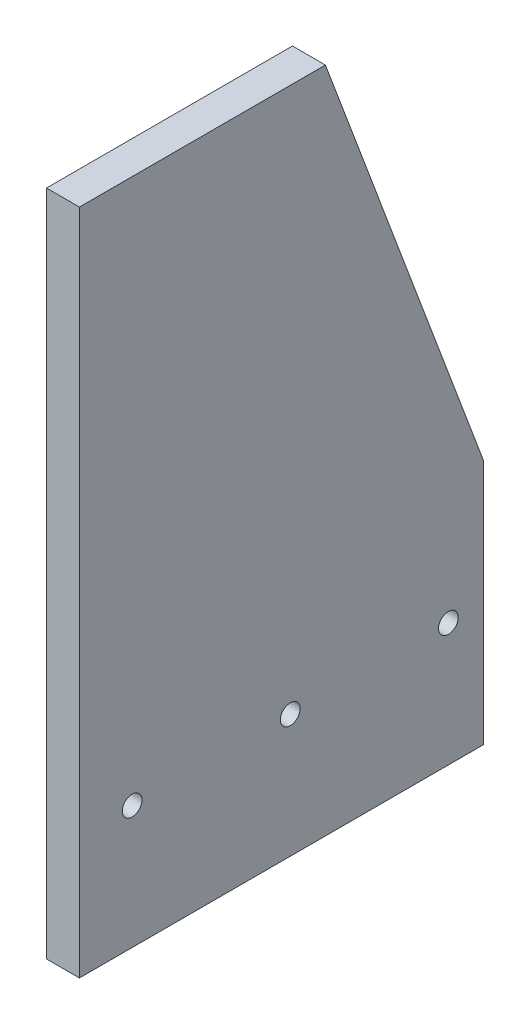
ISO-10303-21;
HEADER;
FILE_DESCRIPTION(('STEP AP214'),'2;1');
FILE_NAME('part.step','',(''),(''),'','','');
FILE_SCHEMA(('AUTOMOTIVE_DESIGN { 1 0 10303 214 1 1 1 1 }'));
ENDSEC;
DATA;
#1=APPLICATION_CONTEXT('core data for automotive mechanical design processes');
#2=APPLICATION_PROTOCOL_DEFINITION('international standard','automotive_design',2000,#1);
#3=PRODUCT_CONTEXT('',#1,'mechanical');
#4=PRODUCT('Part','Part','',(#3));
#5=PRODUCT_RELATED_PRODUCT_CATEGORY('part','',(#4));
#6=PRODUCT_DEFINITION_FORMATION('','',#4);
#7=PRODUCT_DEFINITION_CONTEXT('part definition',#1,'design');
#8=PRODUCT_DEFINITION('design','',#6,#7);
#9=PRODUCT_DEFINITION_SHAPE('','',#8);
#10=(LENGTH_UNIT() NAMED_UNIT(*) SI_UNIT(.MILLI.,.METRE.));
#11=(NAMED_UNIT(*) PLANE_ANGLE_UNIT() SI_UNIT($,.RADIAN.));
#12=(NAMED_UNIT(*) SI_UNIT($,.STERADIAN.) SOLID_ANGLE_UNIT());
#13=UNCERTAINTY_MEASURE_WITH_UNIT(LENGTH_MEASURE(1.E-05),#10,'distance_accuracy_value','');
#14=(GEOMETRIC_REPRESENTATION_CONTEXT(3) GLOBAL_UNCERTAINTY_ASSIGNED_CONTEXT((#13)) GLOBAL_UNIT_ASSIGNED_CONTEXT((#10,
#11,#12)) REPRESENTATION_CONTEXT('',''));
#15=CARTESIAN_POINT('',(0.,0.,0.));
#16=DIRECTION('',(0.,0.,1.));
#17=DIRECTION('',(1.,0.,0.));
#18=AXIS2_PLACEMENT_3D('',#15,#16,#17);
#19=CARTESIAN_POINT('',(11.90625,0.,0.));
#20=DIRECTION('',(-1.,0.,0.));
#21=DIRECTION('',(0.,0.,1.));
#22=AXIS2_PLACEMENT_3D('',#19,#20,#21);
#23=PLANE('',#22);
#24=DIRECTION('',(0.,0.,-1.));
#25=VECTOR('',#24,1.);
#26=CARTESIAN_POINT('',(11.90625,0.,-146.05));
#27=LINE('',#26,#25);
#28=CARTESIAN_POINT('',(11.90625,0.,0.));
#29=VERTEX_POINT('',#28);
#30=CARTESIAN_POINT('',(11.90625,0.,-146.05));
#31=VERTEX_POINT('',#30);
#32=EDGE_CURVE('E131',#29,#31,#27,.T.);
#33=ORIENTED_EDGE('',*,*,#32,.T.);
#34=DIRECTION('',(0.,1.,0.));
#35=VECTOR('',#34,1.);
#36=CARTESIAN_POINT('',(11.90625,88.9,-146.05));
#37=LINE('',#36,#35);
#38=CARTESIAN_POINT('',(11.90625,88.9,-146.05));
#39=VERTEX_POINT('',#38);
#40=EDGE_CURVE('E88',#31,#39,#37,.T.);
#41=ORIENTED_EDGE('',*,*,#40,.T.);
#42=DIRECTION('',(0.,0.936329177569044,0.351123441588392));
#43=VECTOR('',#42,1.);
#44=CARTESIAN_POINT('',(11.90625,241.3,-88.9));
#45=LINE('',#44,#43);
#46=CARTESIAN_POINT('',(11.90625,241.3,-88.9));
#47=VERTEX_POINT('',#46);
#48=EDGE_CURVE('E92',#39,#47,#45,.T.);
#49=ORIENTED_EDGE('',*,*,#48,.T.);
#50=DIRECTION('',(0.,0.,1.));
#51=VECTOR('',#50,1.);
#52=CARTESIAN_POINT('',(11.90625,241.3,0.));
#53=LINE('',#52,#51);
#54=CARTESIAN_POINT('',(11.90625,241.3,0.));
#55=VERTEX_POINT('',#54);
#56=EDGE_CURVE('E96',#47,#55,#53,.T.);
#57=ORIENTED_EDGE('',*,*,#56,.T.);
#58=DIRECTION('',(0.,-1.,0.));
#59=VECTOR('',#58,1.);
#60=CARTESIAN_POINT('',(11.90625,0.,0.));
#61=LINE('',#60,#59);
#62=EDGE_CURVE('E54',#55,#29,#61,.T.);
#63=ORIENTED_EDGE('',*,*,#62,.T.);
#64=EDGE_LOOP('',(#33,#41,#49,#57,#63));
#65=FACE_BOUND('',#64,.T.);
#66=CARTESIAN_POINT('',(11.90625,44.45,-19.05));
#67=DIRECTION('',(1.,0.,0.));
#68=DIRECTION('',(0.,0.,-1.));
#69=AXIS2_PLACEMENT_3D('',#66,#67,#68);
#70=CIRCLE('',#69,3.571875);
#71=CARTESIAN_POINT('',(11.90625,44.45,-22.621875));
#72=VERTEX_POINT('',#71);
#73=EDGE_CURVE('E122',#72,#72,#70,.T.);
#74=ORIENTED_EDGE('',*,*,#73,.F.);
#75=EDGE_LOOP('',(#74));
#76=FACE_BOUND('',#75,.T.);
#77=CARTESIAN_POINT('',(11.90625,44.45,-76.2));
#78=DIRECTION('',(1.,0.,0.));
#79=DIRECTION('',(0.,0.,-1.));
#80=AXIS2_PLACEMENT_3D('',#77,#78,#79);
#81=CIRCLE('',#80,3.57187500000001);
#82=CARTESIAN_POINT('',(11.90625,44.45,-79.771875));
#83=VERTEX_POINT('',#82);
#84=EDGE_CURVE('E187',#83,#83,#81,.T.);
#85=ORIENTED_EDGE('',*,*,#84,.F.);
#86=EDGE_LOOP('',(#85));
#87=FACE_BOUND('',#86,.T.);
#88=CARTESIAN_POINT('',(11.90625,44.45,-133.35));
#89=DIRECTION('',(1.,0.,0.));
#90=DIRECTION('',(0.,0.,-1.));
#91=AXIS2_PLACEMENT_3D('',#88,#89,#90);
#92=CIRCLE('',#91,3.57187500000001);
#93=CARTESIAN_POINT('',(11.90625,44.45,-136.921875));
#94=VERTEX_POINT('',#93);
#95=EDGE_CURVE('E175',#94,#94,#92,.T.);
#96=ORIENTED_EDGE('',*,*,#95,.F.);
#97=EDGE_LOOP('',(#96));
#98=FACE_BOUND('',#97,.T.);
#99=ADVANCED_FACE('F36',(#65,#76,#87,#98),#23,.F.);
#100=CARTESIAN_POINT('',(0.,0.,0.));
#101=DIRECTION('',(-1.,0.,0.));
#102=DIRECTION('',(0.,0.,1.));
#103=AXIS2_PLACEMENT_3D('',#100,#101,#102);
#104=PLANE('',#103);
#105=CARTESIAN_POINT('',(0.,44.45,-76.2));
#106=DIRECTION('',(1.,0.,0.));
#107=DIRECTION('',(0.,0.,-1.));
#108=AXIS2_PLACEMENT_3D('',#105,#106,#107);
#109=CIRCLE('',#108,3.57187500000001);
#110=CARTESIAN_POINT('',(0.,44.45,-79.771875));
#111=VERTEX_POINT('',#110);
#112=EDGE_CURVE('E184',#111,#111,#109,.T.);
#113=ORIENTED_EDGE('',*,*,#112,.T.);
#114=EDGE_LOOP('',(#113));
#115=FACE_BOUND('',#114,.T.);
#116=DIRECTION('',(0.,0.,-1.));
#117=VECTOR('',#116,1.);
#118=CARTESIAN_POINT('',(0.,0.,-146.05));
#119=LINE('',#118,#117);
#120=CARTESIAN_POINT('',(0.,0.,0.));
#121=VERTEX_POINT('',#120);
#122=CARTESIAN_POINT('',(0.,0.,-146.05));
#123=VERTEX_POINT('',#122);
#124=EDGE_CURVE('E117',#121,#123,#119,.T.);
#125=ORIENTED_EDGE('',*,*,#124,.F.);
#126=DIRECTION('',(0.,-1.,0.));
#127=VECTOR('',#126,1.);
#128=CARTESIAN_POINT('',(0.,0.,0.));
#129=LINE('',#128,#127);
#130=CARTESIAN_POINT('',(0.,241.3,0.));
#131=VERTEX_POINT('',#130);
#132=EDGE_CURVE('E80',#131,#121,#129,.T.);
#133=ORIENTED_EDGE('',*,*,#132,.F.);
#134=DIRECTION('',(0.,0.,1.));
#135=VECTOR('',#134,1.);
#136=CARTESIAN_POINT('',(0.,241.3,0.));
#137=LINE('',#136,#135);
#138=CARTESIAN_POINT('',(0.,241.3,-88.9));
#139=VERTEX_POINT('',#138);
#140=EDGE_CURVE('E74',#139,#131,#137,.T.);
#141=ORIENTED_EDGE('',*,*,#140,.F.);
#142=DIRECTION('',(0.,0.936329177569044,0.351123441588392));
#143=VECTOR('',#142,1.);
#144=CARTESIAN_POINT('',(0.,241.3,-88.9));
#145=LINE('',#144,#143);
#146=CARTESIAN_POINT('',(0.,88.9,-146.05));
#147=VERTEX_POINT('',#146);
#148=EDGE_CURVE('E104',#147,#139,#145,.T.);
#149=ORIENTED_EDGE('',*,*,#148,.F.);
#150=DIRECTION('',(0.,1.,0.));
#151=VECTOR('',#150,1.);
#152=CARTESIAN_POINT('',(0.,88.9,-146.05));
#153=LINE('',#152,#151);
#154=EDGE_CURVE('E121',#123,#147,#153,.T.);
#155=ORIENTED_EDGE('',*,*,#154,.F.);
#156=EDGE_LOOP('',(#125,#133,#141,#149,#155));
#157=FACE_BOUND('',#156,.T.);
#158=CARTESIAN_POINT('',(0.,44.45,-19.05));
#159=DIRECTION('',(1.,0.,0.));
#160=DIRECTION('',(0.,0.,-1.));
#161=AXIS2_PLACEMENT_3D('',#158,#159,#160);
#162=CIRCLE('',#161,3.571875);
#163=CARTESIAN_POINT('',(0.,44.45,-22.621875));
#164=VERTEX_POINT('',#163);
#165=EDGE_CURVE('E191',#164,#164,#162,.T.);
#166=ORIENTED_EDGE('',*,*,#165,.T.);
#167=EDGE_LOOP('',(#166));
#168=FACE_BOUND('',#167,.T.);
#169=CARTESIAN_POINT('',(0.,44.45,-133.35));
#170=DIRECTION('',(1.,0.,0.));
#171=DIRECTION('',(0.,0.,-1.));
#172=AXIS2_PLACEMENT_3D('',#169,#170,#171);
#173=CIRCLE('',#172,3.57187500000001);
#174=CARTESIAN_POINT('',(0.,44.45,-136.921875));
#175=VERTEX_POINT('',#174);
#176=EDGE_CURVE('E178',#175,#175,#173,.T.);
#177=ORIENTED_EDGE('',*,*,#176,.T.);
#178=EDGE_LOOP('',(#177));
#179=FACE_BOUND('',#178,.T.);
#180=ADVANCED_FACE('F139',(#115,#157,#168,#179),#104,.T.);
#181=CARTESIAN_POINT('',(11.90625,0.,-146.05));
#182=DIRECTION('',(0.,1.,0.));
#183=DIRECTION('',(0.,0.,1.));
#184=AXIS2_PLACEMENT_3D('',#181,#182,#183);
#185=PLANE('',#184);
#186=ORIENTED_EDGE('',*,*,#124,.T.);
#187=DIRECTION('',(-1.,0.,0.));
#188=VECTOR('',#187,1.);
#189=CARTESIAN_POINT('',(11.90625,0.,-146.05));
#190=LINE('',#189,#188);
#191=EDGE_CURVE('E11',#31,#123,#190,.T.);
#192=ORIENTED_EDGE('',*,*,#191,.F.);
#193=ORIENTED_EDGE('',*,*,#32,.F.);
#194=DIRECTION('',(-1.,0.,0.));
#195=VECTOR('',#194,1.);
#196=CARTESIAN_POINT('',(11.90625,0.,0.));
#197=LINE('',#196,#195);
#198=EDGE_CURVE('E113',#29,#121,#197,.T.);
#199=ORIENTED_EDGE('',*,*,#198,.T.);
#200=EDGE_LOOP('',(#186,#192,#193,#199));
#201=FACE_BOUND('',#200,.T.);
#202=ADVANCED_FACE('F38',(#201),#185,.F.);
#203=CARTESIAN_POINT('',(11.90625,88.9,-146.05));
#204=DIRECTION('',(0.,0.,1.));
#205=DIRECTION('',(1.,0.,0.));
#206=AXIS2_PLACEMENT_3D('',#203,#204,#205);
#207=PLANE('',#206);
#208=ORIENTED_EDGE('',*,*,#154,.T.);
#209=DIRECTION('',(-1.,0.,0.));
#210=VECTOR('',#209,1.);
#211=CARTESIAN_POINT('',(11.90625,88.9,-146.05));
#212=LINE('',#211,#210);
#213=EDGE_CURVE('E46',#39,#147,#212,.T.);
#214=ORIENTED_EDGE('',*,*,#213,.F.);
#215=ORIENTED_EDGE('',*,*,#40,.F.);
#216=ORIENTED_EDGE('',*,*,#191,.T.);
#217=EDGE_LOOP('',(#208,#214,#215,#216));
#218=FACE_BOUND('',#217,.T.);
#219=ADVANCED_FACE('F251',(#218),#207,.F.);
#220=CARTESIAN_POINT('',(11.90625,241.3,-88.9));
#221=DIRECTION('',(0.,-0.351123441588392,0.936329177569044));
#222=DIRECTION('',(0.,-0.936329177569045,-0.351123441588392));
#223=AXIS2_PLACEMENT_3D('',#220,#221,#222);
#224=PLANE('',#223);
#225=ORIENTED_EDGE('',*,*,#148,.T.);
#226=DIRECTION('',(-1.,0.,0.));
#227=VECTOR('',#226,1.);
#228=CARTESIAN_POINT('',(11.90625,241.3,-88.9));
#229=LINE('',#228,#227);
#230=EDGE_CURVE('E101',#47,#139,#229,.T.);
#231=ORIENTED_EDGE('',*,*,#230,.F.);
#232=ORIENTED_EDGE('',*,*,#48,.F.);
#233=ORIENTED_EDGE('',*,*,#213,.T.);
#234=EDGE_LOOP('',(#225,#231,#232,#233));
#235=FACE_BOUND('',#234,.T.);
#236=ADVANCED_FACE('F102',(#235),#224,.F.);
#237=CARTESIAN_POINT('',(11.90625,241.3,0.));
#238=DIRECTION('',(0.,-1.,0.));
#239=DIRECTION('',(0.,0.,-1.));
#240=AXIS2_PLACEMENT_3D('',#237,#238,#239);
#241=PLANE('',#240);
#242=ORIENTED_EDGE('',*,*,#140,.T.);
#243=DIRECTION('',(-1.,0.,0.));
#244=VECTOR('',#243,1.);
#245=CARTESIAN_POINT('',(11.90625,241.3,0.));
#246=LINE('',#245,#244);
#247=EDGE_CURVE('E106',#55,#131,#246,.T.);
#248=ORIENTED_EDGE('',*,*,#247,.F.);
#249=ORIENTED_EDGE('',*,*,#56,.F.);
#250=ORIENTED_EDGE('',*,*,#230,.T.);
#251=EDGE_LOOP('',(#242,#248,#249,#250));
#252=FACE_BOUND('',#251,.T.);
#253=ADVANCED_FACE('F108',(#252),#241,.F.);
#254=CARTESIAN_POINT('',(11.90625,0.,0.));
#255=DIRECTION('',(0.,0.,-1.));
#256=DIRECTION('',(-1.,0.,0.));
#257=AXIS2_PLACEMENT_3D('',#254,#255,#256);
#258=PLANE('',#257);
#259=ORIENTED_EDGE('',*,*,#132,.T.);
#260=ORIENTED_EDGE('',*,*,#198,.F.);
#261=ORIENTED_EDGE('',*,*,#62,.F.);
#262=ORIENTED_EDGE('',*,*,#247,.T.);
#263=EDGE_LOOP('',(#259,#260,#261,#262));
#264=FACE_BOUND('',#263,.T.);
#265=ADVANCED_FACE('F144',(#264),#258,.F.);
#266=CARTESIAN_POINT('',(11.90625,44.45,-19.05));
#267=DIRECTION('',(-1.,0.,0.));
#268=DIRECTION('',(0.,0.,1.));
#269=AXIS2_PLACEMENT_3D('',#266,#267,#268);
#270=CYLINDRICAL_SURFACE('',#269,3.571875);
#271=ORIENTED_EDGE('',*,*,#73,.T.);
#272=EDGE_LOOP('',(#271));
#273=FACE_BOUND('',#272,.T.);
#274=ORIENTED_EDGE('',*,*,#165,.F.);
#275=EDGE_LOOP('',(#274));
#276=FACE_BOUND('',#275,.T.);
#277=ADVANCED_FACE('F146',(#273,#276),#270,.F.);
#278=CARTESIAN_POINT('',(11.90625,44.45,-76.2));
#279=DIRECTION('',(-1.,0.,0.));
#280=DIRECTION('',(0.,0.,1.));
#281=AXIS2_PLACEMENT_3D('',#278,#279,#280);
#282=CYLINDRICAL_SURFACE('',#281,3.57187500000001);
#283=ORIENTED_EDGE('',*,*,#84,.T.);
#284=EDGE_LOOP('',(#283));
#285=FACE_BOUND('',#284,.T.);
#286=ORIENTED_EDGE('',*,*,#112,.F.);
#287=EDGE_LOOP('',(#286));
#288=FACE_BOUND('',#287,.T.);
#289=ADVANCED_FACE('F152',(#285,#288),#282,.F.);
#290=CARTESIAN_POINT('',(11.90625,44.45,-133.35));
#291=DIRECTION('',(-1.,0.,0.));
#292=DIRECTION('',(0.,0.,1.));
#293=AXIS2_PLACEMENT_3D('',#290,#291,#292);
#294=CYLINDRICAL_SURFACE('',#293,3.57187500000001);
#295=ORIENTED_EDGE('',*,*,#95,.T.);
#296=EDGE_LOOP('',(#295));
#297=FACE_BOUND('',#296,.T.);
#298=ORIENTED_EDGE('',*,*,#176,.F.);
#299=EDGE_LOOP('',(#298));
#300=FACE_BOUND('',#299,.T.);
#301=ADVANCED_FACE('F166',(#297,#300),#294,.F.);
#302=CLOSED_SHELL('',(#99,#180,#202,#219,#236,#253,#265,#277,#289,#301));
#303=MANIFOLD_SOLID_BREP('B2',#302);
#304=ADVANCED_BREP_SHAPE_REPRESENTATION('',(#18,#303),#14);
#305=SHAPE_DEFINITION_REPRESENTATION(#9,#304);
ENDSEC;
END-ISO-10303-21;
